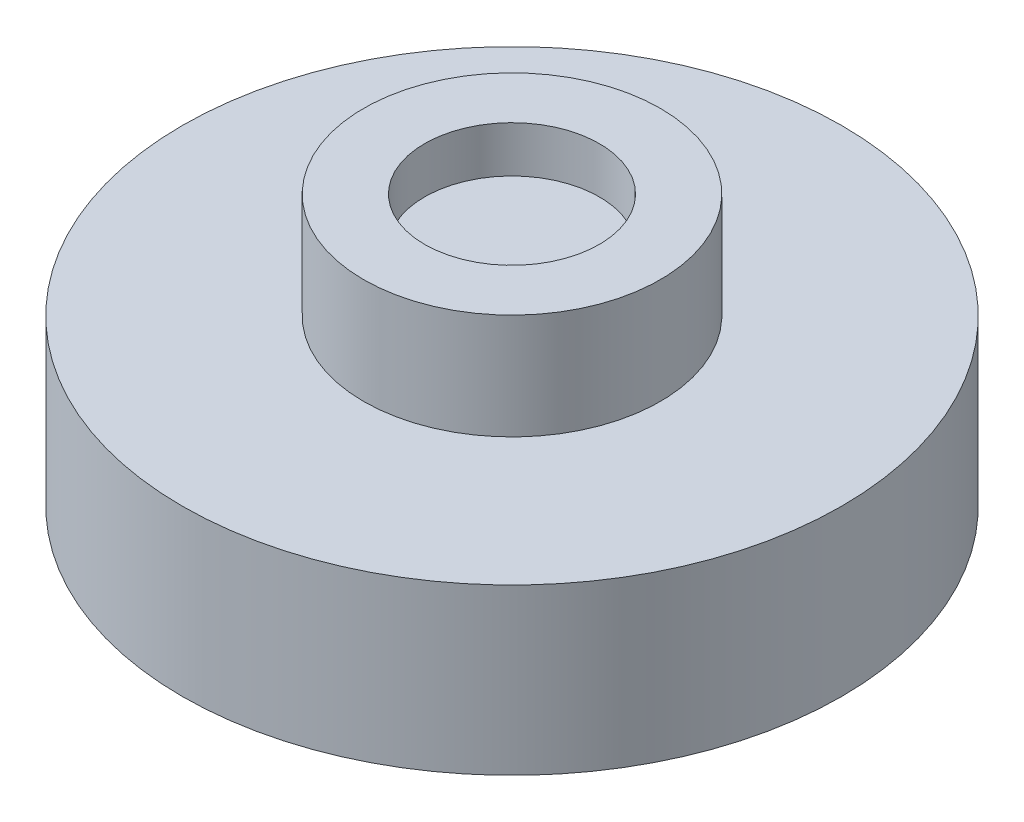
ISO-10303-21;
HEADER;
FILE_DESCRIPTION(('STEP AP214'),'2;1');
FILE_NAME('part.step','',(''),(''),'','','');
FILE_SCHEMA(('AUTOMOTIVE_DESIGN { 1 0 10303 214 1 1 1 1 }'));
ENDSEC;
DATA;
#1=APPLICATION_CONTEXT('core data for automotive mechanical design processes');
#2=APPLICATION_PROTOCOL_DEFINITION('international standard','automotive_design',2000,#1);
#3=PRODUCT_CONTEXT('',#1,'mechanical');
#4=PRODUCT('Part','Part','',(#3));
#5=PRODUCT_RELATED_PRODUCT_CATEGORY('part','',(#4));
#6=PRODUCT_DEFINITION_FORMATION('','',#4);
#7=PRODUCT_DEFINITION_CONTEXT('part definition',#1,'design');
#8=PRODUCT_DEFINITION('design','',#6,#7);
#9=PRODUCT_DEFINITION_SHAPE('','',#8);
#10=(LENGTH_UNIT() NAMED_UNIT(*) SI_UNIT(.MILLI.,.METRE.));
#11=(NAMED_UNIT(*) PLANE_ANGLE_UNIT() SI_UNIT($,.RADIAN.));
#12=(NAMED_UNIT(*) SI_UNIT($,.STERADIAN.) SOLID_ANGLE_UNIT());
#13=UNCERTAINTY_MEASURE_WITH_UNIT(LENGTH_MEASURE(1.E-05),#10,'distance_accuracy_value','');
#14=(GEOMETRIC_REPRESENTATION_CONTEXT(3) GLOBAL_UNCERTAINTY_ASSIGNED_CONTEXT((#13)) GLOBAL_UNIT_ASSIGNED_CONTEXT((#10,
#11,#12)) REPRESENTATION_CONTEXT('',''));
#15=CARTESIAN_POINT('',(0.,0.,0.));
#16=DIRECTION('',(0.,0.,1.));
#17=DIRECTION('',(1.,0.,0.));
#18=AXIS2_PLACEMENT_3D('',#15,#16,#17);
#19=CARTESIAN_POINT('',(0.,3.8,0.));
#20=DIRECTION('',(0.,-1.,0.));
#21=DIRECTION('',(0.,0.,-1.));
#22=AXIS2_PLACEMENT_3D('',#19,#20,#21);
#23=CYLINDRICAL_SURFACE('',#22,4.5);
#24=CARTESIAN_POINT('',(0.,0.,0.));
#25=DIRECTION('',(0.,1.,0.));
#26=DIRECTION('',(0.,0.,1.));
#27=AXIS2_PLACEMENT_3D('',#24,#25,#26);
#28=CIRCLE('',#27,4.5);
#29=CARTESIAN_POINT('',(0.,0.,4.5));
#30=VERTEX_POINT('',#29);
#31=EDGE_CURVE('E55',#30,#30,#28,.T.);
#32=ORIENTED_EDGE('',*,*,#31,.T.);
#33=EDGE_LOOP('',(#32));
#34=FACE_BOUND('',#33,.T.);
#35=CARTESIAN_POINT('',(0.,3.2,0.));
#36=DIRECTION('',(0.,1.,0.));
#37=DIRECTION('',(0.,0.,1.));
#38=AXIS2_PLACEMENT_3D('',#35,#36,#37);
#39=CIRCLE('',#38,4.5);
#40=CARTESIAN_POINT('',(0.,3.2,4.5));
#41=VERTEX_POINT('',#40);
#42=EDGE_CURVE('E67',#41,#41,#39,.T.);
#43=ORIENTED_EDGE('',*,*,#42,.F.);
#44=EDGE_LOOP('',(#43));
#45=FACE_BOUND('',#44,.T.);
#46=ADVANCED_FACE('F47',(#34,#45),#23,.T.);
#47=CARTESIAN_POINT('',(0.,-5.,0.));
#48=DIRECTION('',(0.,1.,0.));
#49=DIRECTION('',(0.,0.,1.));
#50=AXIS2_PLACEMENT_3D('',#47,#48,#49);
#51=CYLINDRICAL_SURFACE('',#50,10.);
#52=CARTESIAN_POINT('',(0.,-5.,0.));
#53=DIRECTION('',(0.,-1.,0.));
#54=DIRECTION('',(0.,0.,-1.));
#55=AXIS2_PLACEMENT_3D('',#52,#53,#54);
#56=CIRCLE('',#55,10.);
#57=CARTESIAN_POINT('',(0.,-5.,-10.));
#58=VERTEX_POINT('',#57);
#59=EDGE_CURVE('E60',#58,#58,#56,.T.);
#60=ORIENTED_EDGE('',*,*,#59,.F.);
#61=EDGE_LOOP('',(#60));
#62=FACE_BOUND('',#61,.T.);
#63=CARTESIAN_POINT('',(0.,0.,0.));
#64=DIRECTION('',(0.,-1.,0.));
#65=DIRECTION('',(0.,0.,-1.));
#66=AXIS2_PLACEMENT_3D('',#63,#64,#65);
#67=CIRCLE('',#66,10.);
#68=CARTESIAN_POINT('',(0.,0.,-10.));
#69=VERTEX_POINT('',#68);
#70=EDGE_CURVE('E63',#69,#69,#67,.T.);
#71=ORIENTED_EDGE('',*,*,#70,.T.);
#72=EDGE_LOOP('',(#71));
#73=FACE_BOUND('',#72,.T.);
#74=ADVANCED_FACE('F97',(#62,#73),#51,.T.);
#75=CARTESIAN_POINT('',(0.,-5.,0.));
#76=DIRECTION('',(0.,-1.,0.));
#77=DIRECTION('',(0.,0.,-1.));
#78=AXIS2_PLACEMENT_3D('',#75,#76,#77);
#79=PLANE('',#78);
#80=ORIENTED_EDGE('',*,*,#59,.T.);
#81=EDGE_LOOP('',(#80));
#82=FACE_BOUND('',#81,.T.);
#83=ADVANCED_FACE('F93',(#82),#79,.T.);
#84=CARTESIAN_POINT('',(0.,0.,0.));
#85=DIRECTION('',(0.,-1.,0.));
#86=DIRECTION('',(0.,0.,-1.));
#87=AXIS2_PLACEMENT_3D('',#84,#85,#86);
#88=PLANE('',#87);
#89=ORIENTED_EDGE('',*,*,#31,.F.);
#90=EDGE_LOOP('',(#89));
#91=FACE_BOUND('',#90,.T.);
#92=ORIENTED_EDGE('',*,*,#70,.F.);
#93=EDGE_LOOP('',(#92));
#94=FACE_BOUND('',#93,.T.);
#95=ADVANCED_FACE('F84',(#91,#94),#88,.F.);
#96=CARTESIAN_POINT('',(0.,3.2,0.));
#97=DIRECTION('',(0.,1.,0.));
#98=DIRECTION('',(0.,0.,1.));
#99=AXIS2_PLACEMENT_3D('',#96,#97,#98);
#100=PLANE('',#99);
#101=CARTESIAN_POINT('',(0.,3.2,0.));
#102=DIRECTION('',(0.,1.,0.));
#103=DIRECTION('',(0.,0.,1.));
#104=AXIS2_PLACEMENT_3D('',#101,#102,#103);
#105=CIRCLE('',#104,2.65);
#106=CARTESIAN_POINT('',(0.,3.2,2.65));
#107=VERTEX_POINT('',#106);
#108=EDGE_CURVE('E50',#107,#107,#105,.T.);
#109=ORIENTED_EDGE('',*,*,#108,.F.);
#110=EDGE_LOOP('',(#109));
#111=FACE_BOUND('',#110,.T.);
#112=ORIENTED_EDGE('',*,*,#42,.T.);
#113=EDGE_LOOP('',(#112));
#114=FACE_BOUND('',#113,.T.);
#115=ADVANCED_FACE('F81',(#111,#114),#100,.T.);
#116=CARTESIAN_POINT('',(0.,1.8,0.));
#117=DIRECTION('',(0.,1.,0.));
#118=DIRECTION('',(0.,0.,1.));
#119=AXIS2_PLACEMENT_3D('',#116,#117,#118);
#120=PLANE('',#119);
#121=CARTESIAN_POINT('',(0.,1.8,0.));
#122=DIRECTION('',(0.,1.,0.));
#123=DIRECTION('',(0.,0.,1.));
#124=AXIS2_PLACEMENT_3D('',#121,#122,#123);
#125=CIRCLE('',#124,2.65);
#126=CARTESIAN_POINT('',(0.,1.8,2.65));
#127=VERTEX_POINT('',#126);
#128=EDGE_CURVE('E11',#127,#127,#125,.T.);
#129=ORIENTED_EDGE('',*,*,#128,.T.);
#130=EDGE_LOOP('',(#129));
#131=FACE_BOUND('',#130,.T.);
#132=ADVANCED_FACE('F83',(#131),#120,.T.);
#133=CARTESIAN_POINT('',(0.,3.8,0.));
#134=DIRECTION('',(0.,-1.,0.));
#135=DIRECTION('',(0.,0.,-1.));
#136=AXIS2_PLACEMENT_3D('',#133,#134,#135);
#137=CYLINDRICAL_SURFACE('',#136,2.65);
#138=ORIENTED_EDGE('',*,*,#128,.F.);
#139=EDGE_LOOP('',(#138));
#140=FACE_BOUND('',#139,.T.);
#141=ORIENTED_EDGE('',*,*,#108,.T.);
#142=EDGE_LOOP('',(#141));
#143=FACE_BOUND('',#142,.T.);
#144=ADVANCED_FACE('F79',(#140,#143),#137,.F.);
#145=CLOSED_SHELL('',(#46,#74,#83,#95,#115,#132,#144));
#146=MANIFOLD_SOLID_BREP('B2',#145);
#147=ADVANCED_BREP_SHAPE_REPRESENTATION('',(#18,#146),#14);
#148=SHAPE_DEFINITION_REPRESENTATION(#9,#147);
ENDSEC;
END-ISO-10303-21;
